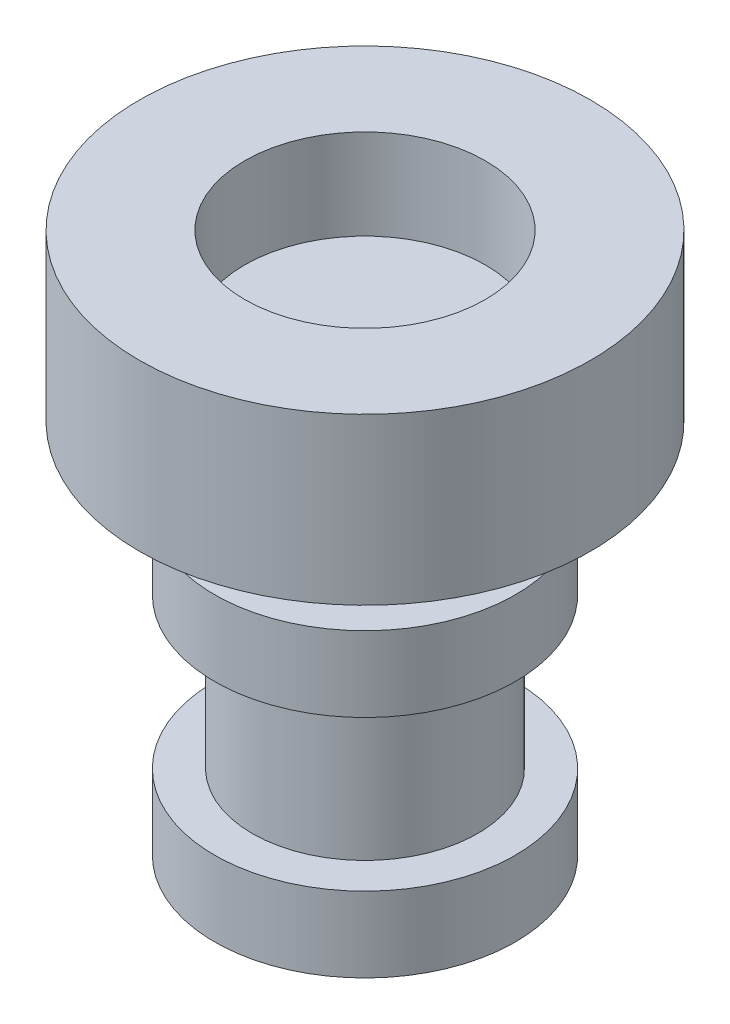
ISO-10303-21;
HEADER;
FILE_DESCRIPTION(('STEP AP214'),'2;1');
FILE_NAME('part.step','',(''),(''),'','','');
FILE_SCHEMA(('AUTOMOTIVE_DESIGN { 1 0 10303 214 1 1 1 1 }'));
ENDSEC;
DATA;
#1=APPLICATION_CONTEXT('core data for automotive mechanical design processes');
#2=APPLICATION_PROTOCOL_DEFINITION('international standard','automotive_design',2000,#1);
#3=PRODUCT_CONTEXT('',#1,'mechanical');
#4=PRODUCT('Part','Part','',(#3));
#5=PRODUCT_RELATED_PRODUCT_CATEGORY('part','',(#4));
#6=PRODUCT_DEFINITION_FORMATION('','',#4);
#7=PRODUCT_DEFINITION_CONTEXT('part definition',#1,'design');
#8=PRODUCT_DEFINITION('design','',#6,#7);
#9=PRODUCT_DEFINITION_SHAPE('','',#8);
#10=(LENGTH_UNIT() NAMED_UNIT(*) SI_UNIT(.MILLI.,.METRE.));
#11=(NAMED_UNIT(*) PLANE_ANGLE_UNIT() SI_UNIT($,.RADIAN.));
#12=(NAMED_UNIT(*) SI_UNIT($,.STERADIAN.) SOLID_ANGLE_UNIT());
#13=UNCERTAINTY_MEASURE_WITH_UNIT(LENGTH_MEASURE(1.E-05),#10,'distance_accuracy_value','');
#14=(GEOMETRIC_REPRESENTATION_CONTEXT(3) GLOBAL_UNCERTAINTY_ASSIGNED_CONTEXT((#13)) GLOBAL_UNIT_ASSIGNED_CONTEXT((#10,
#11,#12)) REPRESENTATION_CONTEXT('',''));
#15=CARTESIAN_POINT('',(0.,0.,0.));
#16=DIRECTION('',(0.,0.,1.));
#17=DIRECTION('',(1.,0.,0.));
#18=AXIS2_PLACEMENT_3D('',#15,#16,#17);
#19=CARTESIAN_POINT('',(-0.522013311509166,-5.,-0.51113803418606));
#20=DIRECTION('',(0.,1.,0.));
#21=DIRECTION('',(0.,0.,1.));
#22=AXIS2_PLACEMENT_3D('',#19,#20,#21);
#23=CYLINDRICAL_SURFACE('',#22,1.5);
#24=CARTESIAN_POINT('',(-0.522013311509166,-2.,-0.51113803418606));
#25=DIRECTION('',(0.,-1.,0.));
#26=DIRECTION('',(0.,0.,-1.));
#27=AXIS2_PLACEMENT_3D('',#24,#25,#26);
#28=CIRCLE('',#27,1.5);
#29=CARTESIAN_POINT('',(-0.522013311509166,-2.,-2.01113803418606));
#30=VERTEX_POINT('',#29);
#31=EDGE_CURVE('E52',#30,#30,#28,.T.);
#32=ORIENTED_EDGE('',*,*,#31,.T.);
#33=EDGE_LOOP('',(#32));
#34=FACE_BOUND('',#33,.T.);
#35=CARTESIAN_POINT('',(-0.522013311509166,-4.,-0.51113803418606));
#36=DIRECTION('',(0.,-1.,0.));
#37=DIRECTION('',(0.,0.,-1.));
#38=AXIS2_PLACEMENT_3D('',#35,#36,#37);
#39=CIRCLE('',#38,1.5);
#40=CARTESIAN_POINT('',(-0.522013311509166,-4.,-2.01113803418606));
#41=VERTEX_POINT('',#40);
#42=EDGE_CURVE('E10',#41,#41,#39,.T.);
#43=ORIENTED_EDGE('',*,*,#42,.F.);
#44=EDGE_LOOP('',(#43));
#45=FACE_BOUND('',#44,.T.);
#46=ADVANCED_FACE('F44',(#34,#45),#23,.T.);
#47=CARTESIAN_POINT('',(-0.522013311509166,2.2,-0.51113803418606));
#48=DIRECTION('',(0.,1.,0.));
#49=DIRECTION('',(0.,0.,1.));
#50=AXIS2_PLACEMENT_3D('',#47,#48,#49);
#51=PLANE('',#50);
#52=CARTESIAN_POINT('',(-0.522013311509166,2.2,-0.51113803418606));
#53=DIRECTION('',(0.,1.,0.));
#54=DIRECTION('',(0.,0.,1.));
#55=AXIS2_PLACEMENT_3D('',#52,#53,#54);
#56=CIRCLE('',#55,3.);
#57=CARTESIAN_POINT('',(-0.522013311509166,2.2,2.48886196581394));
#58=VERTEX_POINT('',#57);
#59=EDGE_CURVE('E87',#58,#58,#56,.T.);
#60=ORIENTED_EDGE('',*,*,#59,.T.);
#61=EDGE_LOOP('',(#60));
#62=FACE_BOUND('',#61,.T.);
#63=CARTESIAN_POINT('',(-0.522013311509166,2.2,-0.51113803418606));
#64=DIRECTION('',(0.,1.,0.));
#65=DIRECTION('',(0.,0.,1.));
#66=AXIS2_PLACEMENT_3D('',#63,#64,#65);
#67=CIRCLE('',#66,1.6);
#68=CARTESIAN_POINT('',(-0.522013311509166,2.2,1.08886196581394));
#69=VERTEX_POINT('',#68);
#70=EDGE_CURVE('E81',#69,#69,#67,.T.);
#71=ORIENTED_EDGE('',*,*,#70,.F.);
#72=EDGE_LOOP('',(#71));
#73=FACE_BOUND('',#72,.T.);
#74=ADVANCED_FACE('F105',(#62,#73),#51,.T.);
#75=CARTESIAN_POINT('',(-0.522013311509166,0.,-0.51113803418606));
#76=DIRECTION('',(0.,1.,0.));
#77=DIRECTION('',(0.,0.,1.));
#78=AXIS2_PLACEMENT_3D('',#75,#76,#77);
#79=PLANE('',#78);
#80=CARTESIAN_POINT('',(-0.522013311509166,0.,-0.51113803418606));
#81=DIRECTION('',(0.,-1.,0.));
#82=DIRECTION('',(0.,0.,-1.));
#83=AXIS2_PLACEMENT_3D('',#80,#81,#82);
#84=CIRCLE('',#83,1.5);
#85=CARTESIAN_POINT('',(-0.522013311509166,0.,-2.01113803418606));
#86=VERTEX_POINT('',#85);
#87=EDGE_CURVE('E57',#86,#86,#84,.T.);
#88=ORIENTED_EDGE('',*,*,#87,.F.);
#89=EDGE_LOOP('',(#88));
#90=FACE_BOUND('',#89,.T.);
#91=CARTESIAN_POINT('',(-0.522013311509166,0.,-0.51113803418606));
#92=DIRECTION('',(0.,1.,0.));
#93=DIRECTION('',(0.,0.,1.));
#94=AXIS2_PLACEMENT_3D('',#91,#92,#93);
#95=CIRCLE('',#94,3.);
#96=CARTESIAN_POINT('',(-0.522013311509166,0.,2.48886196581394));
#97=VERTEX_POINT('',#96);
#98=EDGE_CURVE('E86',#97,#97,#95,.T.);
#99=ORIENTED_EDGE('',*,*,#98,.F.);
#100=EDGE_LOOP('',(#99));
#101=FACE_BOUND('',#100,.T.);
#102=ADVANCED_FACE('F107',(#90,#101),#79,.F.);
#103=CARTESIAN_POINT('',(-0.522013311509166,2.2,-0.51113803418606));
#104=DIRECTION('',(0.,-1.,0.));
#105=DIRECTION('',(0.,0.,-1.));
#106=AXIS2_PLACEMENT_3D('',#103,#104,#105);
#107=CYLINDRICAL_SURFACE('',#106,3.);
#108=ORIENTED_EDGE('',*,*,#59,.F.);
#109=EDGE_LOOP('',(#108));
#110=FACE_BOUND('',#109,.T.);
#111=ORIENTED_EDGE('',*,*,#98,.T.);
#112=EDGE_LOOP('',(#111));
#113=FACE_BOUND('',#112,.T.);
#114=ADVANCED_FACE('F46',(#110,#113),#107,.T.);
#115=CARTESIAN_POINT('',(-0.522013311509166,2.2,-0.51113803418606));
#116=DIRECTION('',(0.,-1.,0.));
#117=DIRECTION('',(0.,0.,-1.));
#118=AXIS2_PLACEMENT_3D('',#115,#116,#117);
#119=CYLINDRICAL_SURFACE('',#118,1.6);
#120=CARTESIAN_POINT('',(-0.522013311509166,1.,-0.51113803418606));
#121=DIRECTION('',(0.,1.,0.));
#122=DIRECTION('',(0.,0.,1.));
#123=AXIS2_PLACEMENT_3D('',#120,#121,#122);
#124=CIRCLE('',#123,1.6);
#125=CARTESIAN_POINT('',(-0.522013311509166,1.,1.08886196581394));
#126=VERTEX_POINT('',#125);
#127=EDGE_CURVE('E63',#126,#126,#124,.T.);
#128=ORIENTED_EDGE('',*,*,#127,.F.);
#129=EDGE_LOOP('',(#128));
#130=FACE_BOUND('',#129,.T.);
#131=ORIENTED_EDGE('',*,*,#70,.T.);
#132=EDGE_LOOP('',(#131));
#133=FACE_BOUND('',#132,.T.);
#134=ADVANCED_FACE('F99',(#130,#133),#119,.F.);
#135=CARTESIAN_POINT('',(0.,1.,0.));
#136=DIRECTION('',(0.,1.,0.));
#137=DIRECTION('',(0.,0.,1.));
#138=AXIS2_PLACEMENT_3D('',#135,#136,#137);
#139=PLANE('',#138);
#140=ORIENTED_EDGE('',*,*,#127,.T.);
#141=EDGE_LOOP('',(#140));
#142=FACE_BOUND('',#141,.T.);
#143=ADVANCED_FACE('F97',(#142),#139,.T.);
#144=CARTESIAN_POINT('',(-0.522013311509166,-1.,-0.51113803418606));
#145=DIRECTION('',(0.,1.,0.));
#146=DIRECTION('',(0.,0.,1.));
#147=AXIS2_PLACEMENT_3D('',#144,#145,#146);
#148=CYLINDRICAL_SURFACE('',#147,1.5);
#149=CARTESIAN_POINT('',(-0.522013311509166,-1.,-0.51113803418606));
#150=DIRECTION('',(0.,-1.,0.));
#151=DIRECTION('',(0.,0.,-1.));
#152=AXIS2_PLACEMENT_3D('',#149,#150,#151);
#153=CIRCLE('',#152,1.5);
#154=CARTESIAN_POINT('',(-0.522013311509166,-1.,-2.01113803418606));
#155=VERTEX_POINT('',#154);
#156=EDGE_CURVE('E73',#155,#155,#153,.T.);
#157=ORIENTED_EDGE('',*,*,#156,.F.);
#158=EDGE_LOOP('',(#157));
#159=FACE_BOUND('',#158,.T.);
#160=ORIENTED_EDGE('',*,*,#87,.T.);
#161=EDGE_LOOP('',(#160));
#162=FACE_BOUND('',#161,.T.);
#163=ADVANCED_FACE('F119',(#159,#162),#148,.T.);
#164=CARTESIAN_POINT('',(-0.522013311509166,-2.,-0.51113803418606));
#165=DIRECTION('',(0.,1.,0.));
#166=DIRECTION('',(0.,0.,1.));
#167=AXIS2_PLACEMENT_3D('',#164,#165,#166);
#168=CYLINDRICAL_SURFACE('',#167,2.);
#169=CARTESIAN_POINT('',(-0.522013311509166,-2.,-0.51113803418606));
#170=DIRECTION('',(0.,-1.,0.));
#171=DIRECTION('',(0.,0.,-1.));
#172=AXIS2_PLACEMENT_3D('',#169,#170,#171);
#173=CIRCLE('',#172,2.);
#174=CARTESIAN_POINT('',(-0.522013311509166,-2.,-2.51113803418606));
#175=VERTEX_POINT('',#174);
#176=EDGE_CURVE('E69',#175,#175,#173,.T.);
#177=ORIENTED_EDGE('',*,*,#176,.F.);
#178=EDGE_LOOP('',(#177));
#179=FACE_BOUND('',#178,.T.);
#180=CARTESIAN_POINT('',(-0.522013311509166,-1.,-0.51113803418606));
#181=DIRECTION('',(0.,-1.,0.));
#182=DIRECTION('',(0.,0.,-1.));
#183=AXIS2_PLACEMENT_3D('',#180,#181,#182);
#184=CIRCLE('',#183,2.);
#185=CARTESIAN_POINT('',(-0.522013311509166,-1.,-2.51113803418606));
#186=VERTEX_POINT('',#185);
#187=EDGE_CURVE('E74',#186,#186,#184,.T.);
#188=ORIENTED_EDGE('',*,*,#187,.T.);
#189=EDGE_LOOP('',(#188));
#190=FACE_BOUND('',#189,.T.);
#191=ADVANCED_FACE('F122',(#179,#190),#168,.T.);
#192=CARTESIAN_POINT('',(-0.522013311509166,-2.,-0.51113803418606));
#193=DIRECTION('',(0.,-1.,0.));
#194=DIRECTION('',(0.,0.,-1.));
#195=AXIS2_PLACEMENT_3D('',#192,#193,#194);
#196=PLANE('',#195);
#197=ORIENTED_EDGE('',*,*,#31,.F.);
#198=EDGE_LOOP('',(#197));
#199=FACE_BOUND('',#198,.T.);
#200=ORIENTED_EDGE('',*,*,#176,.T.);
#201=EDGE_LOOP('',(#200));
#202=FACE_BOUND('',#201,.T.);
#203=ADVANCED_FACE('F126',(#199,#202),#196,.T.);
#204=CARTESIAN_POINT('',(-0.522013311509166,-1.,-0.51113803418606));
#205=DIRECTION('',(0.,-1.,0.));
#206=DIRECTION('',(0.,0.,-1.));
#207=AXIS2_PLACEMENT_3D('',#204,#205,#206);
#208=PLANE('',#207);
#209=ORIENTED_EDGE('',*,*,#156,.T.);
#210=EDGE_LOOP('',(#209));
#211=FACE_BOUND('',#210,.T.);
#212=ORIENTED_EDGE('',*,*,#187,.F.);
#213=EDGE_LOOP('',(#212));
#214=FACE_BOUND('',#213,.T.);
#215=ADVANCED_FACE('F128',(#211,#214),#208,.F.);
#216=CARTESIAN_POINT('',(-0.522013311509166,-4.,-0.51113803418606));
#217=DIRECTION('',(0.,-1.,0.));
#218=DIRECTION('',(0.,0.,-1.));
#219=AXIS2_PLACEMENT_3D('',#216,#217,#218);
#220=CYLINDRICAL_SURFACE('',#219,2.);
#221=CARTESIAN_POINT('',(-0.522013311509166,-4.,-0.51113803418606));
#222=DIRECTION('',(0.,-1.,0.));
#223=DIRECTION('',(0.,0.,-1.));
#224=AXIS2_PLACEMENT_3D('',#221,#222,#223);
#225=CIRCLE('',#224,2.);
#226=CARTESIAN_POINT('',(-0.522013311509166,-4.,-2.51113803418606));
#227=VERTEX_POINT('',#226);
#228=EDGE_CURVE('E78',#227,#227,#225,.T.);
#229=ORIENTED_EDGE('',*,*,#228,.T.);
#230=EDGE_LOOP('',(#229));
#231=FACE_BOUND('',#230,.T.);
#232=CARTESIAN_POINT('',(-0.522013311509166,-5.,-0.51113803418606));
#233=DIRECTION('',(0.,-1.,0.));
#234=DIRECTION('',(0.,0.,-1.));
#235=AXIS2_PLACEMENT_3D('',#232,#233,#234);
#236=CIRCLE('',#235,2.);
#237=CARTESIAN_POINT('',(-0.522013311509166,-5.,-2.51113803418606));
#238=VERTEX_POINT('',#237);
#239=EDGE_CURVE('E67',#238,#238,#236,.T.);
#240=ORIENTED_EDGE('',*,*,#239,.F.);
#241=EDGE_LOOP('',(#240));
#242=FACE_BOUND('',#241,.T.);
#243=ADVANCED_FACE('F131',(#231,#242),#220,.T.);
#244=CARTESIAN_POINT('',(-0.522013311509166,-4.,-0.51113803418606));
#245=DIRECTION('',(0.,-1.,0.));
#246=DIRECTION('',(0.,0.,-1.));
#247=AXIS2_PLACEMENT_3D('',#244,#245,#246);
#248=PLANE('',#247);
#249=ORIENTED_EDGE('',*,*,#42,.T.);
#250=EDGE_LOOP('',(#249));
#251=FACE_BOUND('',#250,.T.);
#252=ORIENTED_EDGE('',*,*,#228,.F.);
#253=EDGE_LOOP('',(#252));
#254=FACE_BOUND('',#253,.T.);
#255=ADVANCED_FACE('F139',(#251,#254),#248,.F.);
#256=CARTESIAN_POINT('',(-0.522013311509166,-5.,-0.51113803418606));
#257=DIRECTION('',(0.,-1.,0.));
#258=DIRECTION('',(0.,0.,-1.));
#259=AXIS2_PLACEMENT_3D('',#256,#257,#258);
#260=PLANE('',#259);
#261=ORIENTED_EDGE('',*,*,#239,.T.);
#262=EDGE_LOOP('',(#261));
#263=FACE_BOUND('',#262,.T.);
#264=ADVANCED_FACE('F136',(#263),#260,.T.);
#265=CLOSED_SHELL('',(#46,#74,#102,#114,#134,#143,#163,#191,#203,#215,#243,#255,#264));
#266=MANIFOLD_SOLID_BREP('B2',#265);
#267=ADVANCED_BREP_SHAPE_REPRESENTATION('',(#18,#266),#14);
#268=SHAPE_DEFINITION_REPRESENTATION(#9,#267);
ENDSEC;
END-ISO-10303-21;
